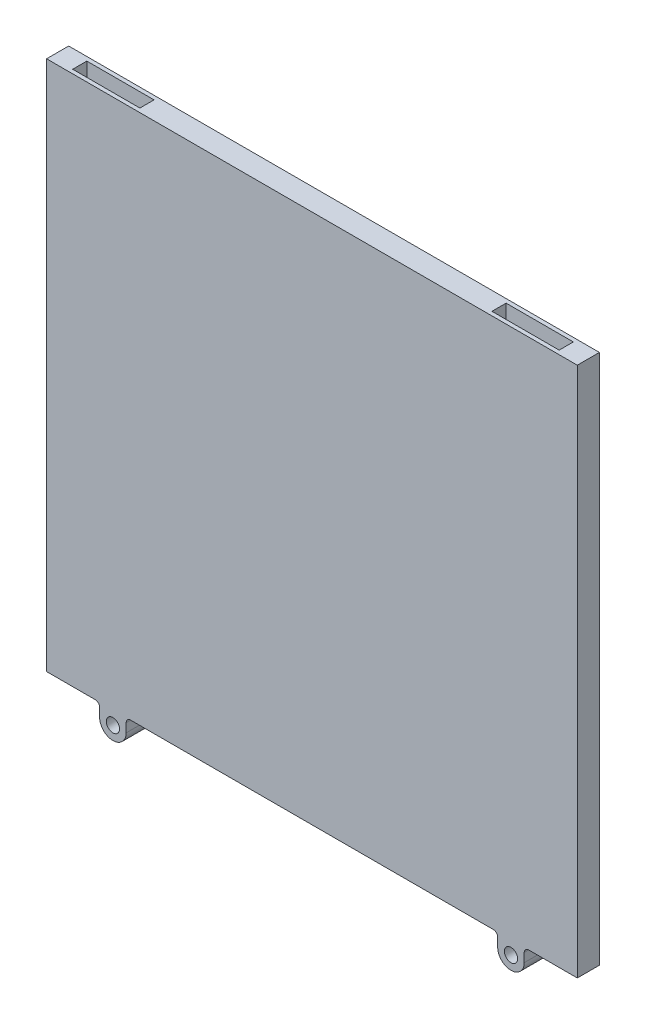
ISO-10303-21;
HEADER;
FILE_DESCRIPTION(('STEP AP214'),'2;1');
FILE_NAME('part.step','',(''),(''),'','','');
FILE_SCHEMA(('AUTOMOTIVE_DESIGN { 1 0 10303 214 1 1 1 1 }'));
ENDSEC;
DATA;
#1=APPLICATION_CONTEXT('core data for automotive mechanical design processes');
#2=APPLICATION_PROTOCOL_DEFINITION('international standard','automotive_design',2000,#1);
#3=PRODUCT_CONTEXT('',#1,'mechanical');
#4=PRODUCT('Part','Part','',(#3));
#5=PRODUCT_RELATED_PRODUCT_CATEGORY('part','',(#4));
#6=PRODUCT_DEFINITION_FORMATION('','',#4);
#7=PRODUCT_DEFINITION_CONTEXT('part definition',#1,'design');
#8=PRODUCT_DEFINITION('design','',#6,#7);
#9=PRODUCT_DEFINITION_SHAPE('','',#8);
#10=(LENGTH_UNIT() NAMED_UNIT(*) SI_UNIT(.MILLI.,.METRE.));
#11=(NAMED_UNIT(*) PLANE_ANGLE_UNIT() SI_UNIT($,.RADIAN.));
#12=(NAMED_UNIT(*) SI_UNIT($,.STERADIAN.) SOLID_ANGLE_UNIT());
#13=UNCERTAINTY_MEASURE_WITH_UNIT(LENGTH_MEASURE(1.E-05),#10,'distance_accuracy_value','');
#14=(GEOMETRIC_REPRESENTATION_CONTEXT(3) GLOBAL_UNCERTAINTY_ASSIGNED_CONTEXT((#13)) GLOBAL_UNIT_ASSIGNED_CONTEXT((#10,
#11,#12)) REPRESENTATION_CONTEXT('',''));
#15=CARTESIAN_POINT('',(0.,0.,0.));
#16=DIRECTION('',(0.,0.,1.));
#17=DIRECTION('',(1.,0.,0.));
#18=AXIS2_PLACEMENT_3D('',#15,#16,#17);
#19=CARTESIAN_POINT('',(60.,-60.,2.5));
#20=DIRECTION('',(0.,-1.,0.));
#21=DIRECTION('',(1.,0.,0.));
#22=AXIS2_PLACEMENT_3D('',#19,#20,#21);
#23=PLANE('',#22);
#24=DIRECTION('',(-1.,0.,0.));
#25=VECTOR('',#24,1.);
#26=CARTESIAN_POINT('',(60.,-60.,-2.5));
#27=LINE('',#26,#25);
#28=CARTESIAN_POINT('',(-49.,-60.,-2.5));
#29=VERTEX_POINT('',#28);
#30=CARTESIAN_POINT('',(-60.,-60.,-2.5));
#31=VERTEX_POINT('',#30);
#32=EDGE_CURVE('E287',#29,#31,#27,.T.);
#33=ORIENTED_EDGE('',*,*,#32,.F.);
#34=DIRECTION('',(0.,0.,1.));
#35=VECTOR('',#34,1.);
#36=CARTESIAN_POINT('',(-49.,-60.,2.5));
#37=LINE('',#36,#35);
#38=CARTESIAN_POINT('',(-49.,-60.,2.5));
#39=VERTEX_POINT('',#38);
#40=EDGE_CURVE('E376',#29,#39,#37,.T.);
#41=ORIENTED_EDGE('',*,*,#40,.T.);
#42=DIRECTION('',(-1.,0.,0.));
#43=VECTOR('',#42,1.);
#44=CARTESIAN_POINT('',(60.,-60.,2.5));
#45=LINE('',#44,#43);
#46=CARTESIAN_POINT('',(-60.,-60.,2.5));
#47=VERTEX_POINT('',#46);
#48=EDGE_CURVE('E329',#39,#47,#45,.T.);
#49=ORIENTED_EDGE('',*,*,#48,.T.);
#50=DIRECTION('',(0.,0.,-1.));
#51=VECTOR('',#50,1.);
#52=CARTESIAN_POINT('',(-60.,-60.,2.5));
#53=LINE('',#52,#51);
#54=EDGE_CURVE('E336',#47,#31,#53,.T.);
#55=ORIENTED_EDGE('',*,*,#54,.T.);
#56=EDGE_LOOP('',(#33,#41,#49,#55));
#57=FACE_BOUND('',#56,.T.);
#58=ADVANCED_FACE('F37',(#57),#23,.T.);
#59=CARTESIAN_POINT('',(41.,-60.,2.5));
#60=VERTEX_POINT('',#59);
#61=CARTESIAN_POINT('',(-41.,-60.,2.5));
#62=VERTEX_POINT('',#61);
#63=EDGE_CURVE('E328',#60,#62,#45,.T.);
#64=ORIENTED_EDGE('',*,*,#63,.T.);
#65=DIRECTION('',(0.,0.,1.));
#66=VECTOR('',#65,1.);
#67=CARTESIAN_POINT('',(-41.,-60.,2.5));
#68=LINE('',#67,#66);
#69=CARTESIAN_POINT('',(-41.,-60.,-2.5));
#70=VERTEX_POINT('',#69);
#71=EDGE_CURVE('E52',#62,#70,#68,.F.);
#72=ORIENTED_EDGE('',*,*,#71,.T.);
#73=CARTESIAN_POINT('',(41.,-60.,-2.5));
#74=VERTEX_POINT('',#73);
#75=EDGE_CURVE('E341',#74,#70,#27,.T.);
#76=ORIENTED_EDGE('',*,*,#75,.F.);
#77=DIRECTION('',(0.,0.,1.));
#78=VECTOR('',#77,1.);
#79=CARTESIAN_POINT('',(41.,-60.,2.5));
#80=LINE('',#79,#78);
#81=EDGE_CURVE('E363',#74,#60,#80,.T.);
#82=ORIENTED_EDGE('',*,*,#81,.T.);
#83=EDGE_LOOP('',(#64,#72,#76,#82));
#84=FACE_BOUND('',#83,.T.);
#85=ADVANCED_FACE('F410',(#84),#23,.T.);
#86=CARTESIAN_POINT('',(60.,-60.,2.5));
#87=VERTEX_POINT('',#86);
#88=CARTESIAN_POINT('',(49.,-60.,2.5));
#89=VERTEX_POINT('',#88);
#90=EDGE_CURVE('E324',#87,#89,#45,.T.);
#91=ORIENTED_EDGE('',*,*,#90,.T.);
#92=DIRECTION('',(0.,0.,1.));
#93=VECTOR('',#92,1.);
#94=CARTESIAN_POINT('',(49.,-60.,-2.5));
#95=LINE('',#94,#93);
#96=CARTESIAN_POINT('',(49.,-60.,-2.5));
#97=VERTEX_POINT('',#96);
#98=EDGE_CURVE('E361',#89,#97,#95,.F.);
#99=ORIENTED_EDGE('',*,*,#98,.T.);
#100=CARTESIAN_POINT('',(60.,-60.,-2.5));
#101=VERTEX_POINT('',#100);
#102=EDGE_CURVE('E337',#101,#97,#27,.T.);
#103=ORIENTED_EDGE('',*,*,#102,.F.);
#104=DIRECTION('',(0.,0.,-1.));
#105=VECTOR('',#104,1.);
#106=CARTESIAN_POINT('',(60.,-60.,2.5));
#107=LINE('',#106,#105);
#108=EDGE_CURVE('E349',#87,#101,#107,.T.);
#109=ORIENTED_EDGE('',*,*,#108,.F.);
#110=EDGE_LOOP('',(#91,#99,#103,#109));
#111=FACE_BOUND('',#110,.T.);
#112=ADVANCED_FACE('F412',(#111),#23,.T.);
#113=CARTESIAN_POINT('',(60.,-60.,2.5));
#114=DIRECTION('',(-1.,0.,0.));
#115=DIRECTION('',(0.,0.,1.));
#116=AXIS2_PLACEMENT_3D('',#113,#114,#115);
#117=PLANE('',#116);
#118=DIRECTION('',(0.,1.,0.));
#119=VECTOR('',#118,1.);
#120=CARTESIAN_POINT('',(60.,-60.,-2.5));
#121=LINE('',#120,#119);
#122=CARTESIAN_POINT('',(60.,60.,-2.5));
#123=VERTEX_POINT('',#122);
#124=EDGE_CURVE('E347',#101,#123,#121,.T.);
#125=ORIENTED_EDGE('',*,*,#124,.T.);
#126=DIRECTION('',(0.,0.,-1.));
#127=VECTOR('',#126,1.);
#128=CARTESIAN_POINT('',(60.,60.,2.5));
#129=LINE('',#128,#127);
#130=CARTESIAN_POINT('',(60.,60.,2.5));
#131=VERTEX_POINT('',#130);
#132=EDGE_CURVE('E352',#131,#123,#129,.T.);
#133=ORIENTED_EDGE('',*,*,#132,.F.);
#134=DIRECTION('',(0.,1.,0.));
#135=VECTOR('',#134,1.);
#136=CARTESIAN_POINT('',(60.,-60.,2.5));
#137=LINE('',#136,#135);
#138=EDGE_CURVE('E334',#87,#131,#137,.T.);
#139=ORIENTED_EDGE('',*,*,#138,.F.);
#140=ORIENTED_EDGE('',*,*,#108,.T.);
#141=EDGE_LOOP('',(#125,#133,#139,#140));
#142=FACE_BOUND('',#141,.T.);
#143=ADVANCED_FACE('F419',(#142),#117,.F.);
#144=CARTESIAN_POINT('',(60.,60.,2.5));
#145=DIRECTION('',(0.,-1.,0.));
#146=DIRECTION('',(1.,0.,0.));
#147=AXIS2_PLACEMENT_3D('',#144,#145,#146);
#148=PLANE('',#147);
#149=DIRECTION('',(-1.,0.,0.));
#150=VECTOR('',#149,1.);
#151=CARTESIAN_POINT('',(-55.,60.,-1.6));
#152=LINE('',#151,#150);
#153=CARTESIAN_POINT('',(-39.8,60.,-1.6));
#154=VERTEX_POINT('',#153);
#155=CARTESIAN_POINT('',(-55.,60.,-1.6));
#156=VERTEX_POINT('',#155);
#157=EDGE_CURVE('E276',#154,#156,#152,.T.);
#158=ORIENTED_EDGE('',*,*,#157,.F.);
#159=DIRECTION('',(0.,0.,-1.));
#160=VECTOR('',#159,1.);
#161=CARTESIAN_POINT('',(-39.8,60.,1.6));
#162=LINE('',#161,#160);
#163=CARTESIAN_POINT('',(-39.8,60.,1.6));
#164=VERTEX_POINT('',#163);
#165=EDGE_CURVE('E274',#164,#154,#162,.T.);
#166=ORIENTED_EDGE('',*,*,#165,.F.);
#167=DIRECTION('',(1.,0.,0.));
#168=VECTOR('',#167,1.);
#169=CARTESIAN_POINT('',(-55.,60.,1.6));
#170=LINE('',#169,#168);
#171=CARTESIAN_POINT('',(-55.,60.,1.6));
#172=VERTEX_POINT('',#171);
#173=EDGE_CURVE('E264',#172,#164,#170,.T.);
#174=ORIENTED_EDGE('',*,*,#173,.F.);
#175=DIRECTION('',(0.,0.,1.));
#176=VECTOR('',#175,1.);
#177=CARTESIAN_POINT('',(-55.,60.,1.6));
#178=LINE('',#177,#176);
#179=EDGE_CURVE('E280',#156,#172,#178,.T.);
#180=ORIENTED_EDGE('',*,*,#179,.F.);
#181=EDGE_LOOP('',(#158,#166,#174,#180));
#182=FACE_BOUND('',#181,.T.);
#183=DIRECTION('',(-1.,0.,0.));
#184=VECTOR('',#183,1.);
#185=CARTESIAN_POINT('',(55.,60.,-1.6));
#186=LINE('',#185,#184);
#187=CARTESIAN_POINT('',(55.,60.,-1.6));
#188=VERTEX_POINT('',#187);
#189=CARTESIAN_POINT('',(39.8,60.,-1.6));
#190=VERTEX_POINT('',#189);
#191=EDGE_CURVE('E310',#188,#190,#186,.T.);
#192=ORIENTED_EDGE('',*,*,#191,.F.);
#193=DIRECTION('',(0.,0.,-1.));
#194=VECTOR('',#193,1.);
#195=CARTESIAN_POINT('',(55.,60.,1.6));
#196=LINE('',#195,#194);
#197=CARTESIAN_POINT('',(55.,60.,1.6));
#198=VERTEX_POINT('',#197);
#199=EDGE_CURVE('E277',#198,#188,#196,.T.);
#200=ORIENTED_EDGE('',*,*,#199,.F.);
#201=DIRECTION('',(1.,0.,0.));
#202=VECTOR('',#201,1.);
#203=CARTESIAN_POINT('',(55.,60.,1.6));
#204=LINE('',#203,#202);
#205=CARTESIAN_POINT('',(39.8,60.,1.6));
#206=VERTEX_POINT('',#205);
#207=EDGE_CURVE('E303',#206,#198,#204,.T.);
#208=ORIENTED_EDGE('',*,*,#207,.F.);
#209=DIRECTION('',(0.,0.,1.));
#210=VECTOR('',#209,1.);
#211=CARTESIAN_POINT('',(39.8,60.,1.6));
#212=LINE('',#211,#210);
#213=EDGE_CURVE('E306',#190,#206,#212,.T.);
#214=ORIENTED_EDGE('',*,*,#213,.F.);
#215=EDGE_LOOP('',(#192,#200,#208,#214));
#216=FACE_BOUND('',#215,.T.);
#217=DIRECTION('',(-1.,0.,0.));
#218=VECTOR('',#217,1.);
#219=CARTESIAN_POINT('',(60.,60.,-2.5));
#220=LINE('',#219,#218);
#221=CARTESIAN_POINT('',(-60.,60.,-2.5));
#222=VERTEX_POINT('',#221);
#223=EDGE_CURVE('E344',#123,#222,#220,.T.);
#224=ORIENTED_EDGE('',*,*,#223,.T.);
#225=DIRECTION('',(0.,0.,-1.));
#226=VECTOR('',#225,1.);
#227=CARTESIAN_POINT('',(-60.,60.,2.5));
#228=LINE('',#227,#226);
#229=CARTESIAN_POINT('',(-60.,60.,2.5));
#230=VERTEX_POINT('',#229);
#231=EDGE_CURVE('E355',#230,#222,#228,.T.);
#232=ORIENTED_EDGE('',*,*,#231,.F.);
#233=DIRECTION('',(-1.,0.,0.));
#234=VECTOR('',#233,1.);
#235=CARTESIAN_POINT('',(60.,60.,2.5));
#236=LINE('',#235,#234);
#237=EDGE_CURVE('E332',#131,#230,#236,.T.);
#238=ORIENTED_EDGE('',*,*,#237,.F.);
#239=ORIENTED_EDGE('',*,*,#132,.T.);
#240=EDGE_LOOP('',(#224,#232,#238,#239));
#241=FACE_BOUND('',#240,.T.);
#242=ADVANCED_FACE('F424',(#182,#216,#241),#148,.F.);
#243=CARTESIAN_POINT('',(-60.,-60.,2.5));
#244=DIRECTION('',(-1.,0.,0.));
#245=DIRECTION('',(0.,0.,1.));
#246=AXIS2_PLACEMENT_3D('',#243,#244,#245);
#247=PLANE('',#246);
#248=DIRECTION('',(0.,1.,0.));
#249=VECTOR('',#248,1.);
#250=CARTESIAN_POINT('',(-60.,-60.,-2.5));
#251=LINE('',#250,#249);
#252=EDGE_CURVE('E340',#31,#222,#251,.T.);
#253=ORIENTED_EDGE('',*,*,#252,.F.);
#254=ORIENTED_EDGE('',*,*,#54,.F.);
#255=DIRECTION('',(0.,1.,0.));
#256=VECTOR('',#255,1.);
#257=CARTESIAN_POINT('',(-60.,-60.,2.5));
#258=LINE('',#257,#256);
#259=EDGE_CURVE('E327',#47,#230,#258,.T.);
#260=ORIENTED_EDGE('',*,*,#259,.T.);
#261=ORIENTED_EDGE('',*,*,#231,.T.);
#262=EDGE_LOOP('',(#253,#254,#260,#261));
#263=FACE_BOUND('',#262,.T.);
#264=ADVANCED_FACE('F454',(#263),#247,.T.);
#265=CARTESIAN_POINT('',(0.,0.,2.5));
#266=DIRECTION('',(0.,0.,-1.));
#267=DIRECTION('',(-1.,0.,0.));
#268=AXIS2_PLACEMENT_3D('',#265,#266,#267);
#269=PLANE('',#268);
#270=ORIENTED_EDGE('',*,*,#90,.F.);
#271=ORIENTED_EDGE('',*,*,#138,.T.);
#272=ORIENTED_EDGE('',*,*,#237,.T.);
#273=ORIENTED_EDGE('',*,*,#259,.F.);
#274=ORIENTED_EDGE('',*,*,#48,.F.);
#275=CARTESIAN_POINT('',(-49.,-61.,2.5));
#276=DIRECTION('',(0.,0.,-1.));
#277=DIRECTION('',(-1.,0.,0.));
#278=AXIS2_PLACEMENT_3D('',#275,#276,#277);
#279=CIRCLE('',#278,1.);
#280=CARTESIAN_POINT('',(-48.,-61.,2.5));
#281=VERTEX_POINT('',#280);
#282=EDGE_CURVE('E221',#39,#281,#279,.T.);
#283=ORIENTED_EDGE('',*,*,#282,.T.);
#284=DIRECTION('',(0.,1.,0.));
#285=VECTOR('',#284,1.);
#286=CARTESIAN_POINT('',(-48.,-63.,2.5));
#287=LINE('',#286,#285);
#288=CARTESIAN_POINT('',(-48.,-63.,2.5));
#289=VERTEX_POINT('',#288);
#290=EDGE_CURVE('E202',#289,#281,#287,.T.);
#291=ORIENTED_EDGE('',*,*,#290,.F.);
#292=CARTESIAN_POINT('',(-45.,-63.,2.5));
#293=DIRECTION('',(0.,0.,-1.));
#294=DIRECTION('',(-1.,0.,0.));
#295=AXIS2_PLACEMENT_3D('',#292,#293,#294);
#296=CIRCLE('',#295,3.);
#297=CARTESIAN_POINT('',(-42.,-63.,2.5));
#298=VERTEX_POINT('',#297);
#299=EDGE_CURVE('E210',#298,#289,#296,.T.);
#300=ORIENTED_EDGE('',*,*,#299,.F.);
#301=DIRECTION('',(0.,-1.,0.));
#302=VECTOR('',#301,1.);
#303=CARTESIAN_POINT('',(-42.,-60.,2.5));
#304=LINE('',#303,#302);
#305=CARTESIAN_POINT('',(-42.,-61.,2.5));
#306=VERTEX_POINT('',#305);
#307=EDGE_CURVE('E222',#306,#298,#304,.T.);
#308=ORIENTED_EDGE('',*,*,#307,.F.);
#309=CARTESIAN_POINT('',(-41.,-61.,2.5));
#310=DIRECTION('',(0.,0.,-1.));
#311=DIRECTION('',(-1.,0.,0.));
#312=AXIS2_PLACEMENT_3D('',#309,#310,#311);
#313=CIRCLE('',#312,1.);
#314=EDGE_CURVE('E45',#306,#62,#313,.T.);
#315=ORIENTED_EDGE('',*,*,#314,.T.);
#316=ORIENTED_EDGE('',*,*,#63,.F.);
#317=CARTESIAN_POINT('',(41.,-61.,2.5));
#318=DIRECTION('',(0.,0.,-1.));
#319=DIRECTION('',(-1.,0.,0.));
#320=AXIS2_PLACEMENT_3D('',#317,#318,#319);
#321=CIRCLE('',#320,1.);
#322=CARTESIAN_POINT('',(42.,-61.,2.5));
#323=VERTEX_POINT('',#322);
#324=EDGE_CURVE('E372',#60,#323,#321,.T.);
#325=ORIENTED_EDGE('',*,*,#324,.T.);
#326=DIRECTION('',(0.,-1.,0.));
#327=VECTOR('',#326,1.);
#328=CARTESIAN_POINT('',(42.,-60.,2.5));
#329=LINE('',#328,#327);
#330=CARTESIAN_POINT('',(42.,-63.,2.5));
#331=VERTEX_POINT('',#330);
#332=EDGE_CURVE('E240',#323,#331,#329,.T.);
#333=ORIENTED_EDGE('',*,*,#332,.T.);
#334=CARTESIAN_POINT('',(45.,-63.,2.5));
#335=DIRECTION('',(0.,0.,1.));
#336=DIRECTION('',(1.,0.,0.));
#337=AXIS2_PLACEMENT_3D('',#334,#335,#336);
#338=CIRCLE('',#337,3.);
#339=CARTESIAN_POINT('',(48.,-63.,2.5));
#340=VERTEX_POINT('',#339);
#341=EDGE_CURVE('E237',#331,#340,#338,.T.);
#342=ORIENTED_EDGE('',*,*,#341,.T.);
#343=DIRECTION('',(0.,1.,0.));
#344=VECTOR('',#343,1.);
#345=CARTESIAN_POINT('',(48.,-63.,2.5));
#346=LINE('',#345,#344);
#347=CARTESIAN_POINT('',(48.,-61.,2.5));
#348=VERTEX_POINT('',#347);
#349=EDGE_CURVE('E233',#340,#348,#346,.T.);
#350=ORIENTED_EDGE('',*,*,#349,.T.);
#351=CARTESIAN_POINT('',(49.,-61.,2.5));
#352=DIRECTION('',(0.,0.,-1.));
#353=DIRECTION('',(-1.,0.,0.));
#354=AXIS2_PLACEMENT_3D('',#351,#352,#353);
#355=CIRCLE('',#354,1.);
#356=EDGE_CURVE('E368',#348,#89,#355,.T.);
#357=ORIENTED_EDGE('',*,*,#356,.T.);
#358=EDGE_LOOP('',(#270,#271,#272,#273,#274,#283,#291,#300,#308,#315,#316,#325,#333,#342,#350,#357));
#359=FACE_BOUND('',#358,.T.);
#360=CARTESIAN_POINT('',(45.,-63.,2.5));
#361=DIRECTION('',(0.,0.,1.));
#362=DIRECTION('',(1.,0.,0.));
#363=AXIS2_PLACEMENT_3D('',#360,#361,#362);
#364=CIRCLE('',#363,1.5);
#365=CARTESIAN_POINT('',(46.5,-63.,2.5));
#366=VERTEX_POINT('',#365);
#367=EDGE_CURVE('E242',#366,#366,#364,.T.);
#368=ORIENTED_EDGE('',*,*,#367,.F.);
#369=EDGE_LOOP('',(#368));
#370=FACE_BOUND('',#369,.T.);
#371=CARTESIAN_POINT('',(-45.,-63.,2.5));
#372=DIRECTION('',(0.,0.,-1.));
#373=DIRECTION('',(-1.,0.,0.));
#374=AXIS2_PLACEMENT_3D('',#371,#372,#373);
#375=CIRCLE('',#374,1.5);
#376=CARTESIAN_POINT('',(-46.5,-63.,2.5));
#377=VERTEX_POINT('',#376);
#378=EDGE_CURVE('E224',#377,#377,#375,.T.);
#379=ORIENTED_EDGE('',*,*,#378,.T.);
#380=EDGE_LOOP('',(#379));
#381=FACE_BOUND('',#380,.T.);
#382=ADVANCED_FACE('F218',(#359,#370,#381),#269,.F.);
#383=CARTESIAN_POINT('',(0.,0.,-2.5));
#384=DIRECTION('',(0.,0.,-1.));
#385=DIRECTION('',(-1.,0.,0.));
#386=AXIS2_PLACEMENT_3D('',#383,#384,#385);
#387=PLANE('',#386);
#388=ORIENTED_EDGE('',*,*,#102,.T.);
#389=CARTESIAN_POINT('',(49.,-61.,-2.5));
#390=DIRECTION('',(0.,0.,-1.));
#391=DIRECTION('',(-1.,0.,0.));
#392=AXIS2_PLACEMENT_3D('',#389,#390,#391);
#393=CIRCLE('',#392,1.);
#394=CARTESIAN_POINT('',(48.,-61.,-2.5));
#395=VERTEX_POINT('',#394);
#396=EDGE_CURVE('E370',#97,#395,#393,.F.);
#397=ORIENTED_EDGE('',*,*,#396,.T.);
#398=DIRECTION('',(0.,1.,0.));
#399=VECTOR('',#398,1.);
#400=CARTESIAN_POINT('',(48.,-63.,-2.5));
#401=LINE('',#400,#399);
#402=CARTESIAN_POINT('',(48.,-63.,-2.5));
#403=VERTEX_POINT('',#402);
#404=EDGE_CURVE('E252',#403,#395,#401,.T.);
#405=ORIENTED_EDGE('',*,*,#404,.F.);
#406=CARTESIAN_POINT('',(45.,-63.,-2.5));
#407=DIRECTION('',(0.,0.,-1.));
#408=DIRECTION('',(-1.,0.,0.));
#409=AXIS2_PLACEMENT_3D('',#406,#407,#408);
#410=CIRCLE('',#409,3.);
#411=CARTESIAN_POINT('',(42.,-63.,-2.5));
#412=VERTEX_POINT('',#411);
#413=EDGE_CURVE('E249',#412,#403,#410,.F.);
#414=ORIENTED_EDGE('',*,*,#413,.F.);
#415=DIRECTION('',(0.,-1.,0.));
#416=VECTOR('',#415,1.);
#417=CARTESIAN_POINT('',(42.,-60.,-2.5));
#418=LINE('',#417,#416);
#419=CARTESIAN_POINT('',(42.,-61.,-2.5));
#420=VERTEX_POINT('',#419);
#421=EDGE_CURVE('E228',#420,#412,#418,.T.);
#422=ORIENTED_EDGE('',*,*,#421,.F.);
#423=CARTESIAN_POINT('',(41.,-61.,-2.5));
#424=DIRECTION('',(0.,0.,-1.));
#425=DIRECTION('',(-1.,0.,0.));
#426=AXIS2_PLACEMENT_3D('',#423,#424,#425);
#427=CIRCLE('',#426,1.);
#428=EDGE_CURVE('E374',#420,#74,#427,.F.);
#429=ORIENTED_EDGE('',*,*,#428,.T.);
#430=ORIENTED_EDGE('',*,*,#75,.T.);
#431=CARTESIAN_POINT('',(-41.,-61.,-2.5));
#432=DIRECTION('',(0.,0.,-1.));
#433=DIRECTION('',(-1.,0.,0.));
#434=AXIS2_PLACEMENT_3D('',#431,#432,#433);
#435=CIRCLE('',#434,1.);
#436=CARTESIAN_POINT('',(-42.,-61.,-2.5));
#437=VERTEX_POINT('',#436);
#438=EDGE_CURVE('E11',#70,#437,#435,.F.);
#439=ORIENTED_EDGE('',*,*,#438,.T.);
#440=DIRECTION('',(0.,-1.,0.));
#441=VECTOR('',#440,1.);
#442=CARTESIAN_POINT('',(-42.,-60.,-2.5));
#443=LINE('',#442,#441);
#444=CARTESIAN_POINT('',(-42.,-63.,-2.5));
#445=VERTEX_POINT('',#444);
#446=EDGE_CURVE('E789',#437,#445,#443,.T.);
#447=ORIENTED_EDGE('',*,*,#446,.T.);
#448=CARTESIAN_POINT('',(-45.,-63.,-2.5));
#449=DIRECTION('',(0.,0.,-1.));
#450=DIRECTION('',(-1.,0.,0.));
#451=AXIS2_PLACEMENT_3D('',#448,#449,#450);
#452=CIRCLE('',#451,3.);
#453=CARTESIAN_POINT('',(-48.,-63.,-2.5));
#454=VERTEX_POINT('',#453);
#455=EDGE_CURVE('E791',#445,#454,#452,.T.);
#456=ORIENTED_EDGE('',*,*,#455,.T.);
#457=DIRECTION('',(0.,1.,0.));
#458=VECTOR('',#457,1.);
#459=CARTESIAN_POINT('',(-48.,-63.,-2.5));
#460=LINE('',#459,#458);
#461=CARTESIAN_POINT('',(-48.,-61.,-2.5));
#462=VERTEX_POINT('',#461);
#463=EDGE_CURVE('E205',#454,#462,#460,.T.);
#464=ORIENTED_EDGE('',*,*,#463,.T.);
#465=CARTESIAN_POINT('',(-49.,-61.,-2.5));
#466=DIRECTION('',(0.,0.,-1.));
#467=DIRECTION('',(-1.,0.,0.));
#468=AXIS2_PLACEMENT_3D('',#465,#466,#467);
#469=CIRCLE('',#468,1.);
#470=EDGE_CURVE('E386',#462,#29,#469,.F.);
#471=ORIENTED_EDGE('',*,*,#470,.T.);
#472=ORIENTED_EDGE('',*,*,#32,.T.);
#473=ORIENTED_EDGE('',*,*,#252,.T.);
#474=ORIENTED_EDGE('',*,*,#223,.F.);
#475=ORIENTED_EDGE('',*,*,#124,.F.);
#476=EDGE_LOOP('',(#388,#397,#405,#414,#422,#429,#430,#439,#447,#456,#464,#471,#472,#473,#474,#475));
#477=FACE_BOUND('',#476,.T.);
#478=CARTESIAN_POINT('',(45.,-63.,-2.5));
#479=DIRECTION('',(0.,0.,-1.));
#480=DIRECTION('',(-1.,0.,0.));
#481=AXIS2_PLACEMENT_3D('',#478,#479,#480);
#482=CIRCLE('',#481,1.5);
#483=CARTESIAN_POINT('',(43.5,-63.,-2.5));
#484=VERTEX_POINT('',#483);
#485=EDGE_CURVE('E236',#484,#484,#482,.F.);
#486=ORIENTED_EDGE('',*,*,#485,.T.);
#487=EDGE_LOOP('',(#486));
#488=FACE_BOUND('',#487,.T.);
#489=CARTESIAN_POINT('',(-45.,-63.,-2.5));
#490=DIRECTION('',(0.,0.,-1.));
#491=DIRECTION('',(-1.,0.,0.));
#492=AXIS2_PLACEMENT_3D('',#489,#490,#491);
#493=CIRCLE('',#492,1.5);
#494=CARTESIAN_POINT('',(-46.5,-63.,-2.5));
#495=VERTEX_POINT('',#494);
#496=EDGE_CURVE('E230',#495,#495,#493,.T.);
#497=ORIENTED_EDGE('',*,*,#496,.F.);
#498=EDGE_LOOP('',(#497));
#499=FACE_BOUND('',#498,.T.);
#500=ADVANCED_FACE('F390',(#477,#488,#499),#387,.T.);
#501=CARTESIAN_POINT('',(55.,40.,1.6));
#502=DIRECTION('',(1.,0.,0.));
#503=DIRECTION('',(0.,1.,0.));
#504=AXIS2_PLACEMENT_3D('',#501,#502,#503);
#505=PLANE('',#504);
#506=ORIENTED_EDGE('',*,*,#199,.T.);
#507=DIRECTION('',(0.,1.,0.));
#508=VECTOR('',#507,1.);
#509=CARTESIAN_POINT('',(55.,40.,-1.6));
#510=LINE('',#509,#508);
#511=CARTESIAN_POINT('',(55.,40.,-1.6));
#512=VERTEX_POINT('',#511);
#513=EDGE_CURVE('E294',#512,#188,#510,.T.);
#514=ORIENTED_EDGE('',*,*,#513,.F.);
#515=DIRECTION('',(0.,0.,-1.));
#516=VECTOR('',#515,1.);
#517=CARTESIAN_POINT('',(55.,40.,1.6));
#518=LINE('',#517,#516);
#519=CARTESIAN_POINT('',(55.,40.,1.6));
#520=VERTEX_POINT('',#519);
#521=EDGE_CURVE('E307',#520,#512,#518,.T.);
#522=ORIENTED_EDGE('',*,*,#521,.F.);
#523=DIRECTION('',(0.,1.,0.));
#524=VECTOR('',#523,1.);
#525=CARTESIAN_POINT('',(55.,40.,1.6));
#526=LINE('',#525,#524);
#527=EDGE_CURVE('E248',#520,#198,#526,.T.);
#528=ORIENTED_EDGE('',*,*,#527,.T.);
#529=EDGE_LOOP('',(#506,#514,#522,#528));
#530=FACE_BOUND('',#529,.T.);
#531=ADVANCED_FACE('F471',(#530),#505,.F.);
#532=CARTESIAN_POINT('',(55.,40.,1.6));
#533=DIRECTION('',(0.,0.,1.));
#534=DIRECTION('',(1.,0.,0.));
#535=AXIS2_PLACEMENT_3D('',#532,#533,#534);
#536=PLANE('',#535);
#537=ORIENTED_EDGE('',*,*,#207,.T.);
#538=ORIENTED_EDGE('',*,*,#527,.F.);
#539=DIRECTION('',(1.,0.,0.));
#540=VECTOR('',#539,1.);
#541=CARTESIAN_POINT('',(55.,40.,1.6));
#542=LINE('',#541,#540);
#543=CARTESIAN_POINT('',(39.8,40.,1.6));
#544=VERTEX_POINT('',#543);
#545=EDGE_CURVE('E297',#544,#520,#542,.T.);
#546=ORIENTED_EDGE('',*,*,#545,.F.);
#547=DIRECTION('',(0.,1.,0.));
#548=VECTOR('',#547,1.);
#549=CARTESIAN_POINT('',(39.8,40.,1.6));
#550=LINE('',#549,#548);
#551=EDGE_CURVE('E300',#544,#206,#550,.T.);
#552=ORIENTED_EDGE('',*,*,#551,.T.);
#553=EDGE_LOOP('',(#537,#538,#546,#552));
#554=FACE_BOUND('',#553,.T.);
#555=ADVANCED_FACE('F480',(#554),#536,.F.);
#556=CARTESIAN_POINT('',(39.8,40.,1.6));
#557=DIRECTION('',(-1.,0.,0.));
#558=DIRECTION('',(0.,-1.,0.));
#559=AXIS2_PLACEMENT_3D('',#556,#557,#558);
#560=PLANE('',#559);
#561=ORIENTED_EDGE('',*,*,#213,.T.);
#562=ORIENTED_EDGE('',*,*,#551,.F.);
#563=DIRECTION('',(0.,0.,1.));
#564=VECTOR('',#563,1.);
#565=CARTESIAN_POINT('',(39.8,40.,1.6));
#566=LINE('',#565,#564);
#567=CARTESIAN_POINT('',(39.8,40.,-1.6));
#568=VERTEX_POINT('',#567);
#569=EDGE_CURVE('E316',#568,#544,#566,.T.);
#570=ORIENTED_EDGE('',*,*,#569,.F.);
#571=DIRECTION('',(0.,1.,0.));
#572=VECTOR('',#571,1.);
#573=CARTESIAN_POINT('',(39.8,40.,-1.6));
#574=LINE('',#573,#572);
#575=EDGE_CURVE('E298',#568,#190,#574,.T.);
#576=ORIENTED_EDGE('',*,*,#575,.T.);
#577=EDGE_LOOP('',(#561,#562,#570,#576));
#578=FACE_BOUND('',#577,.T.);
#579=ADVANCED_FACE('F483',(#578),#560,.F.);
#580=CARTESIAN_POINT('',(55.,40.,-1.6));
#581=DIRECTION('',(0.,0.,-1.));
#582=DIRECTION('',(-1.,0.,0.));
#583=AXIS2_PLACEMENT_3D('',#580,#581,#582);
#584=PLANE('',#583);
#585=ORIENTED_EDGE('',*,*,#191,.T.);
#586=ORIENTED_EDGE('',*,*,#575,.F.);
#587=DIRECTION('',(-1.,0.,0.));
#588=VECTOR('',#587,1.);
#589=CARTESIAN_POINT('',(55.,40.,-1.6));
#590=LINE('',#589,#588);
#591=EDGE_CURVE('E319',#512,#568,#590,.T.);
#592=ORIENTED_EDGE('',*,*,#591,.F.);
#593=ORIENTED_EDGE('',*,*,#513,.T.);
#594=EDGE_LOOP('',(#585,#586,#592,#593));
#595=FACE_BOUND('',#594,.T.);
#596=ADVANCED_FACE('F478',(#595),#584,.F.);
#597=CARTESIAN_POINT('',(0.,40.,0.));
#598=DIRECTION('',(0.,1.,0.));
#599=DIRECTION('',(0.,0.,1.));
#600=AXIS2_PLACEMENT_3D('',#597,#598,#599);
#601=PLANE('',#600);
#602=ORIENTED_EDGE('',*,*,#521,.T.);
#603=ORIENTED_EDGE('',*,*,#591,.T.);
#604=ORIENTED_EDGE('',*,*,#569,.T.);
#605=ORIENTED_EDGE('',*,*,#545,.T.);
#606=EDGE_LOOP('',(#602,#603,#604,#605));
#607=FACE_BOUND('',#606,.T.);
#608=ADVANCED_FACE('F474',(#607),#601,.T.);
#609=CARTESIAN_POINT('',(-39.8,40.,1.6));
#610=DIRECTION('',(1.,0.,0.));
#611=DIRECTION('',(0.,1.,0.));
#612=AXIS2_PLACEMENT_3D('',#609,#610,#611);
#613=PLANE('',#612);
#614=ORIENTED_EDGE('',*,*,#165,.T.);
#615=DIRECTION('',(0.,1.,0.));
#616=VECTOR('',#615,1.);
#617=CARTESIAN_POINT('',(-39.8,40.,-1.6));
#618=LINE('',#617,#616);
#619=CARTESIAN_POINT('',(-39.8,40.,-1.6));
#620=VERTEX_POINT('',#619);
#621=EDGE_CURVE('E273',#620,#154,#618,.T.);
#622=ORIENTED_EDGE('',*,*,#621,.F.);
#623=DIRECTION('',(0.,0.,-1.));
#624=VECTOR('',#623,1.);
#625=CARTESIAN_POINT('',(-39.8,40.,1.6));
#626=LINE('',#625,#624);
#627=CARTESIAN_POINT('',(-39.8,40.,1.6));
#628=VERTEX_POINT('',#627);
#629=EDGE_CURVE('E260',#628,#620,#626,.T.);
#630=ORIENTED_EDGE('',*,*,#629,.F.);
#631=DIRECTION('',(0.,1.,0.));
#632=VECTOR('',#631,1.);
#633=CARTESIAN_POINT('',(-39.8,40.,1.6));
#634=LINE('',#633,#632);
#635=EDGE_CURVE('E285',#628,#164,#634,.T.);
#636=ORIENTED_EDGE('',*,*,#635,.T.);
#637=EDGE_LOOP('',(#614,#622,#630,#636));
#638=FACE_BOUND('',#637,.T.);
#639=ADVANCED_FACE('F477',(#638),#613,.F.);
#640=CARTESIAN_POINT('',(-55.,40.,1.6));
#641=DIRECTION('',(0.,0.,1.));
#642=DIRECTION('',(1.,0.,0.));
#643=AXIS2_PLACEMENT_3D('',#640,#641,#642);
#644=PLANE('',#643);
#645=ORIENTED_EDGE('',*,*,#173,.T.);
#646=ORIENTED_EDGE('',*,*,#635,.F.);
#647=DIRECTION('',(1.,0.,0.));
#648=VECTOR('',#647,1.);
#649=CARTESIAN_POINT('',(-55.,40.,1.6));
#650=LINE('',#649,#648);
#651=CARTESIAN_POINT('',(-55.,40.,1.6));
#652=VERTEX_POINT('',#651);
#653=EDGE_CURVE('E270',#652,#628,#650,.T.);
#654=ORIENTED_EDGE('',*,*,#653,.F.);
#655=DIRECTION('',(0.,1.,0.));
#656=VECTOR('',#655,1.);
#657=CARTESIAN_POINT('',(-55.,40.,1.6));
#658=LINE('',#657,#656);
#659=EDGE_CURVE('E288',#652,#172,#658,.T.);
#660=ORIENTED_EDGE('',*,*,#659,.T.);
#661=EDGE_LOOP('',(#645,#646,#654,#660));
#662=FACE_BOUND('',#661,.T.);
#663=ADVANCED_FACE('F496',(#662),#644,.F.);
#664=CARTESIAN_POINT('',(-55.,40.,1.6));
#665=DIRECTION('',(-1.,0.,0.));
#666=DIRECTION('',(0.,-1.,0.));
#667=AXIS2_PLACEMENT_3D('',#664,#665,#666);
#668=PLANE('',#667);
#669=ORIENTED_EDGE('',*,*,#179,.T.);
#670=ORIENTED_EDGE('',*,*,#659,.F.);
#671=DIRECTION('',(0.,0.,1.));
#672=VECTOR('',#671,1.);
#673=CARTESIAN_POINT('',(-55.,40.,1.6));
#674=LINE('',#673,#672);
#675=CARTESIAN_POINT('',(-55.,40.,-1.6));
#676=VERTEX_POINT('',#675);
#677=EDGE_CURVE('E267',#676,#652,#674,.T.);
#678=ORIENTED_EDGE('',*,*,#677,.F.);
#679=DIRECTION('',(0.,1.,0.));
#680=VECTOR('',#679,1.);
#681=CARTESIAN_POINT('',(-55.,40.,-1.6));
#682=LINE('',#681,#680);
#683=EDGE_CURVE('E290',#676,#156,#682,.T.);
#684=ORIENTED_EDGE('',*,*,#683,.T.);
#685=EDGE_LOOP('',(#669,#670,#678,#684));
#686=FACE_BOUND('',#685,.T.);
#687=ADVANCED_FACE('F502',(#686),#668,.F.);
#688=CARTESIAN_POINT('',(-55.,40.,-1.6));
#689=DIRECTION('',(0.,0.,-1.));
#690=DIRECTION('',(-1.,0.,0.));
#691=AXIS2_PLACEMENT_3D('',#688,#689,#690);
#692=PLANE('',#691);
#693=ORIENTED_EDGE('',*,*,#157,.T.);
#694=ORIENTED_EDGE('',*,*,#683,.F.);
#695=DIRECTION('',(-1.,0.,0.));
#696=VECTOR('',#695,1.);
#697=CARTESIAN_POINT('',(-55.,40.,-1.6));
#698=LINE('',#697,#696);
#699=EDGE_CURVE('E263',#620,#676,#698,.T.);
#700=ORIENTED_EDGE('',*,*,#699,.F.);
#701=ORIENTED_EDGE('',*,*,#621,.T.);
#702=EDGE_LOOP('',(#693,#694,#700,#701));
#703=FACE_BOUND('',#702,.T.);
#704=ADVANCED_FACE('F498',(#703),#692,.F.);
#705=CARTESIAN_POINT('',(0.,40.,0.));
#706=DIRECTION('',(0.,-1.,0.));
#707=DIRECTION('',(0.,0.,-1.));
#708=AXIS2_PLACEMENT_3D('',#705,#706,#707);
#709=PLANE('',#708);
#710=ORIENTED_EDGE('',*,*,#629,.T.);
#711=ORIENTED_EDGE('',*,*,#699,.T.);
#712=ORIENTED_EDGE('',*,*,#677,.T.);
#713=ORIENTED_EDGE('',*,*,#653,.T.);
#714=EDGE_LOOP('',(#710,#711,#712,#713));
#715=FACE_BOUND('',#714,.T.);
#716=ADVANCED_FACE('F501',(#715),#709,.F.);
#717=CARTESIAN_POINT('',(42.,-60.,-10.9852813742386));
#718=DIRECTION('',(-1.,0.,0.));
#719=DIRECTION('',(0.,0.,1.));
#720=AXIS2_PLACEMENT_3D('',#717,#718,#719);
#721=PLANE('',#720);
#722=ORIENTED_EDGE('',*,*,#332,.F.);
#723=DIRECTION('',(0.,0.,1.));
#724=VECTOR('',#723,1.);
#725=CARTESIAN_POINT('',(42.,-61.,-2.5));
#726=LINE('',#725,#724);
#727=EDGE_CURVE('E366',#323,#420,#726,.F.);
#728=ORIENTED_EDGE('',*,*,#727,.T.);
#729=ORIENTED_EDGE('',*,*,#421,.T.);
#730=DIRECTION('',(0.,0.,1.));
#731=VECTOR('',#730,1.);
#732=CARTESIAN_POINT('',(42.,-63.,-10.9852813742386));
#733=LINE('',#732,#731);
#734=EDGE_CURVE('E254',#412,#331,#733,.T.);
#735=ORIENTED_EDGE('',*,*,#734,.T.);
#736=EDGE_LOOP('',(#722,#728,#729,#735));
#737=FACE_BOUND('',#736,.T.);
#738=ADVANCED_FACE('F512',(#737),#721,.T.);
#739=CARTESIAN_POINT('',(48.,-63.,-10.9852813742386));
#740=DIRECTION('',(1.,0.,0.));
#741=DIRECTION('',(0.,0.,-1.));
#742=AXIS2_PLACEMENT_3D('',#739,#740,#741);
#743=PLANE('',#742);
#744=ORIENTED_EDGE('',*,*,#404,.T.);
#745=DIRECTION('',(0.,0.,1.));
#746=VECTOR('',#745,1.);
#747=CARTESIAN_POINT('',(48.,-61.,2.5));
#748=LINE('',#747,#746);
#749=EDGE_CURVE('E351',#395,#348,#748,.T.);
#750=ORIENTED_EDGE('',*,*,#749,.T.);
#751=ORIENTED_EDGE('',*,*,#349,.F.);
#752=DIRECTION('',(0.,0.,1.));
#753=VECTOR('',#752,1.);
#754=CARTESIAN_POINT('',(48.,-63.,-10.9852813742386));
#755=LINE('',#754,#753);
#756=EDGE_CURVE('E245',#403,#340,#755,.T.);
#757=ORIENTED_EDGE('',*,*,#756,.F.);
#758=EDGE_LOOP('',(#744,#750,#751,#757));
#759=FACE_BOUND('',#758,.T.);
#760=ADVANCED_FACE('F438',(#759),#743,.T.);
#761=CARTESIAN_POINT('',(45.,-63.,-10.9852813742386));
#762=DIRECTION('',(0.,0.,1.));
#763=DIRECTION('',(1.,0.,0.));
#764=AXIS2_PLACEMENT_3D('',#761,#762,#763);
#765=CYLINDRICAL_SURFACE('',#764,3.);
#766=ORIENTED_EDGE('',*,*,#734,.F.);
#767=ORIENTED_EDGE('',*,*,#413,.T.);
#768=ORIENTED_EDGE('',*,*,#756,.T.);
#769=ORIENTED_EDGE('',*,*,#341,.F.);
#770=EDGE_LOOP('',(#766,#767,#768,#769));
#771=FACE_BOUND('',#770,.T.);
#772=ADVANCED_FACE('F443',(#771),#765,.T.);
#773=CARTESIAN_POINT('',(45.,-63.,-10.9852813742386));
#774=DIRECTION('',(0.,0.,1.));
#775=DIRECTION('',(1.,0.,0.));
#776=AXIS2_PLACEMENT_3D('',#773,#774,#775);
#777=CYLINDRICAL_SURFACE('',#776,1.5);
#778=ORIENTED_EDGE('',*,*,#367,.T.);
#779=EDGE_LOOP('',(#778));
#780=FACE_BOUND('',#779,.T.);
#781=ORIENTED_EDGE('',*,*,#485,.F.);
#782=EDGE_LOOP('',(#781));
#783=FACE_BOUND('',#782,.T.);
#784=ADVANCED_FACE('F514',(#780,#783),#777,.F.);
#785=CARTESIAN_POINT('',(49.,-61.,-10.9852813742386));
#786=DIRECTION('',(0.,0.,-1.));
#787=DIRECTION('',(-1.,0.,0.));
#788=AXIS2_PLACEMENT_3D('',#785,#786,#787);
#789=CYLINDRICAL_SURFACE('',#788,1.);
#790=ORIENTED_EDGE('',*,*,#396,.F.);
#791=ORIENTED_EDGE('',*,*,#98,.F.);
#792=ORIENTED_EDGE('',*,*,#356,.F.);
#793=ORIENTED_EDGE('',*,*,#749,.F.);
#794=EDGE_LOOP('',(#790,#791,#792,#793));
#795=FACE_BOUND('',#794,.T.);
#796=ADVANCED_FACE('F432',(#795),#789,.F.);
#797=CARTESIAN_POINT('',(41.,-61.,2.5));
#798=DIRECTION('',(0.,0.,-1.));
#799=DIRECTION('',(-1.,0.,0.));
#800=AXIS2_PLACEMENT_3D('',#797,#798,#799);
#801=CYLINDRICAL_SURFACE('',#800,1.);
#802=ORIENTED_EDGE('',*,*,#428,.F.);
#803=ORIENTED_EDGE('',*,*,#727,.F.);
#804=ORIENTED_EDGE('',*,*,#324,.F.);
#805=ORIENTED_EDGE('',*,*,#81,.F.);
#806=EDGE_LOOP('',(#802,#803,#804,#805));
#807=FACE_BOUND('',#806,.T.);
#808=ADVANCED_FACE('F450',(#807),#801,.F.);
#809=CARTESIAN_POINT('',(-48.,-63.,-10.9852813742386));
#810=DIRECTION('',(1.,0.,0.));
#811=DIRECTION('',(0.,0.,-1.));
#812=AXIS2_PLACEMENT_3D('',#809,#810,#811);
#813=PLANE('',#812);
#814=ORIENTED_EDGE('',*,*,#290,.T.);
#815=DIRECTION('',(0.,0.,1.));
#816=VECTOR('',#815,1.);
#817=CARTESIAN_POINT('',(-48.,-61.,-10.9852813742386));
#818=LINE('',#817,#816);
#819=EDGE_CURVE('E379',#281,#462,#818,.F.);
#820=ORIENTED_EDGE('',*,*,#819,.T.);
#821=ORIENTED_EDGE('',*,*,#463,.F.);
#822=DIRECTION('',(0.,0.,1.));
#823=VECTOR('',#822,1.);
#824=CARTESIAN_POINT('',(-48.,-63.,-10.9852813742386));
#825=LINE('',#824,#823);
#826=EDGE_CURVE('E198',#454,#289,#825,.T.);
#827=ORIENTED_EDGE('',*,*,#826,.T.);
#828=EDGE_LOOP('',(#814,#820,#821,#827));
#829=FACE_BOUND('',#828,.T.);
#830=ADVANCED_FACE('F200',(#829),#813,.F.);
#831=CARTESIAN_POINT('',(-45.,-63.,-10.9852813742386));
#832=DIRECTION('',(0.,0.,1.));
#833=DIRECTION('',(1.,0.,0.));
#834=AXIS2_PLACEMENT_3D('',#831,#832,#833);
#835=CYLINDRICAL_SURFACE('',#834,3.);
#836=ORIENTED_EDGE('',*,*,#455,.F.);
#837=DIRECTION('',(0.,0.,1.));
#838=VECTOR('',#837,1.);
#839=CARTESIAN_POINT('',(-42.,-63.,-10.9852813742386));
#840=LINE('',#839,#838);
#841=EDGE_CURVE('E209',#445,#298,#840,.T.);
#842=ORIENTED_EDGE('',*,*,#841,.T.);
#843=ORIENTED_EDGE('',*,*,#299,.T.);
#844=ORIENTED_EDGE('',*,*,#826,.F.);
#845=EDGE_LOOP('',(#836,#842,#843,#844));
#846=FACE_BOUND('',#845,.T.);
#847=ADVANCED_FACE('F214',(#846),#835,.T.);
#848=CARTESIAN_POINT('',(-42.,-60.,-10.9852813742386));
#849=DIRECTION('',(-1.,0.,0.));
#850=DIRECTION('',(0.,0.,1.));
#851=AXIS2_PLACEMENT_3D('',#848,#849,#850);
#852=PLANE('',#851);
#853=ORIENTED_EDGE('',*,*,#446,.F.);
#854=DIRECTION('',(0.,0.,1.));
#855=VECTOR('',#854,1.);
#856=CARTESIAN_POINT('',(-42.,-61.,-10.9852813742386));
#857=LINE('',#856,#855);
#858=EDGE_CURVE('E381',#437,#306,#857,.T.);
#859=ORIENTED_EDGE('',*,*,#858,.T.);
#860=ORIENTED_EDGE('',*,*,#307,.T.);
#861=ORIENTED_EDGE('',*,*,#841,.F.);
#862=EDGE_LOOP('',(#853,#859,#860,#861));
#863=FACE_BOUND('',#862,.T.);
#864=ADVANCED_FACE('F405',(#863),#852,.F.);
#865=CARTESIAN_POINT('',(-45.,-63.,-10.9852813742386));
#866=DIRECTION('',(0.,0.,1.));
#867=DIRECTION('',(1.,0.,0.));
#868=AXIS2_PLACEMENT_3D('',#865,#866,#867);
#869=CYLINDRICAL_SURFACE('',#868,1.5);
#870=ORIENTED_EDGE('',*,*,#378,.F.);
#871=EDGE_LOOP('',(#870));
#872=FACE_BOUND('',#871,.T.);
#873=ORIENTED_EDGE('',*,*,#496,.T.);
#874=EDGE_LOOP('',(#873));
#875=FACE_BOUND('',#874,.T.);
#876=ADVANCED_FACE('F399',(#872,#875),#869,.F.);
#877=CARTESIAN_POINT('',(-49.,-61.,2.5));
#878=DIRECTION('',(0.,0.,1.));
#879=DIRECTION('',(1.,0.,0.));
#880=AXIS2_PLACEMENT_3D('',#877,#878,#879);
#881=CYLINDRICAL_SURFACE('',#880,1.);
#882=ORIENTED_EDGE('',*,*,#470,.F.);
#883=ORIENTED_EDGE('',*,*,#819,.F.);
#884=ORIENTED_EDGE('',*,*,#282,.F.);
#885=ORIENTED_EDGE('',*,*,#40,.F.);
#886=EDGE_LOOP('',(#882,#883,#884,#885));
#887=FACE_BOUND('',#886,.T.);
#888=ADVANCED_FACE('F397',(#887),#881,.F.);
#889=CARTESIAN_POINT('',(-41.,-61.,-10.9852813742386));
#890=DIRECTION('',(0.,0.,1.));
#891=DIRECTION('',(1.,0.,0.));
#892=AXIS2_PLACEMENT_3D('',#889,#890,#891);
#893=CYLINDRICAL_SURFACE('',#892,1.);
#894=ORIENTED_EDGE('',*,*,#438,.F.);
#895=ORIENTED_EDGE('',*,*,#71,.F.);
#896=ORIENTED_EDGE('',*,*,#314,.F.);
#897=ORIENTED_EDGE('',*,*,#858,.F.);
#898=EDGE_LOOP('',(#894,#895,#896,#897));
#899=FACE_BOUND('',#898,.T.);
#900=ADVANCED_FACE('F39',(#899),#893,.F.);
#901=CLOSED_SHELL('',(#58,#85,#112,#143,#242,#264,#382,#500,#531,#555,#579,#596,#608,#639,#663,
#687,#704,#716,#738,#760,#772,#784,#796,#808,#830,#847,#864,#876,#888,#900));
#902=MANIFOLD_SOLID_BREP('B2',#901);
#903=ADVANCED_BREP_SHAPE_REPRESENTATION('',(#18,#902),#14);
#904=SHAPE_DEFINITION_REPRESENTATION(#9,#903);
ENDSEC;
END-ISO-10303-21;
